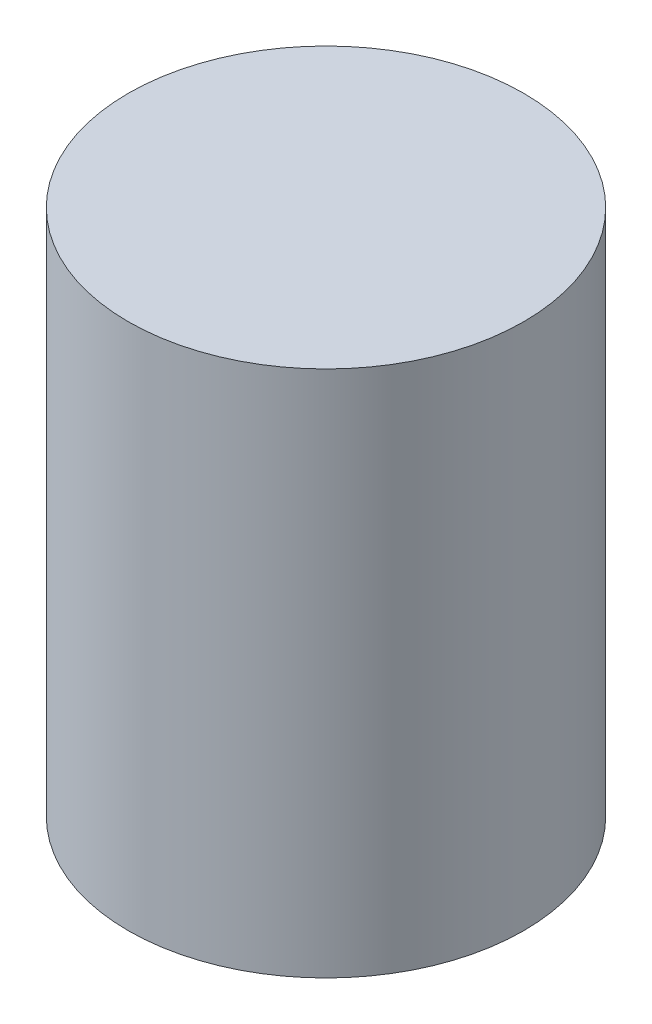
ISO-10303-21;
HEADER;
FILE_DESCRIPTION(('STEP AP214'),'2;1');
FILE_NAME('part.step','',(''),(''),'','','');
FILE_SCHEMA(('AUTOMOTIVE_DESIGN { 1 0 10303 214 1 1 1 1 }'));
ENDSEC;
DATA;
#1=APPLICATION_CONTEXT('core data for automotive mechanical design processes');
#2=APPLICATION_PROTOCOL_DEFINITION('international standard','automotive_design',2000,#1);
#3=PRODUCT_CONTEXT('',#1,'mechanical');
#4=PRODUCT('Part','Part','',(#3));
#5=PRODUCT_RELATED_PRODUCT_CATEGORY('part','',(#4));
#6=PRODUCT_DEFINITION_FORMATION('','',#4);
#7=PRODUCT_DEFINITION_CONTEXT('part definition',#1,'design');
#8=PRODUCT_DEFINITION('design','',#6,#7);
#9=PRODUCT_DEFINITION_SHAPE('','',#8);
#10=(LENGTH_UNIT() NAMED_UNIT(*) SI_UNIT(.MILLI.,.METRE.));
#11=(NAMED_UNIT(*) PLANE_ANGLE_UNIT() SI_UNIT($,.RADIAN.));
#12=(NAMED_UNIT(*) SI_UNIT($,.STERADIAN.) SOLID_ANGLE_UNIT());
#13=UNCERTAINTY_MEASURE_WITH_UNIT(LENGTH_MEASURE(1.E-05),#10,'distance_accuracy_value','');
#14=(GEOMETRIC_REPRESENTATION_CONTEXT(3) GLOBAL_UNCERTAINTY_ASSIGNED_CONTEXT((#13)) GLOBAL_UNIT_ASSIGNED_CONTEXT((#10,
#11,#12)) REPRESENTATION_CONTEXT('',''));
#15=CARTESIAN_POINT('',(0.,0.,0.));
#16=DIRECTION('',(0.,0.,1.));
#17=DIRECTION('',(1.,0.,0.));
#18=AXIS2_PLACEMENT_3D('',#15,#16,#17);
#19=CARTESIAN_POINT('',(0.,4.,0.));
#20=DIRECTION('',(0.,-1.,0.));
#21=DIRECTION('',(0.,0.,-1.));
#22=AXIS2_PLACEMENT_3D('',#19,#20,#21);
#23=CYLINDRICAL_SURFACE('',#22,1.5);
#24=CARTESIAN_POINT('',(0.,4.,0.));
#25=DIRECTION('',(0.,1.,0.));
#26=DIRECTION('',(0.,0.,1.));
#27=AXIS2_PLACEMENT_3D('',#24,#25,#26);
#28=CIRCLE('',#27,1.5);
#29=CARTESIAN_POINT('',(0.,4.,1.5));
#30=VERTEX_POINT('',#29);
#31=EDGE_CURVE('E10',#30,#30,#28,.T.);
#32=ORIENTED_EDGE('',*,*,#31,.F.);
#33=EDGE_LOOP('',(#32));
#34=FACE_BOUND('',#33,.T.);
#35=CARTESIAN_POINT('',(0.,0.,0.));
#36=DIRECTION('',(0.,1.,0.));
#37=DIRECTION('',(0.,0.,1.));
#38=AXIS2_PLACEMENT_3D('',#35,#36,#37);
#39=CIRCLE('',#38,1.5);
#40=CARTESIAN_POINT('',(0.,0.,1.5));
#41=VERTEX_POINT('',#40);
#42=EDGE_CURVE('E46',#41,#41,#39,.T.);
#43=ORIENTED_EDGE('',*,*,#42,.T.);
#44=EDGE_LOOP('',(#43));
#45=FACE_BOUND('',#44,.T.);
#46=ADVANCED_FACE('F43',(#34,#45),#23,.T.);
#47=CARTESIAN_POINT('',(0.,4.,0.));
#48=DIRECTION('',(0.,1.,0.));
#49=DIRECTION('',(0.,0.,1.));
#50=AXIS2_PLACEMENT_3D('',#47,#48,#49);
#51=PLANE('',#50);
#52=ORIENTED_EDGE('',*,*,#31,.T.);
#53=EDGE_LOOP('',(#52));
#54=FACE_BOUND('',#53,.T.);
#55=ADVANCED_FACE('F58',(#54),#51,.T.);
#56=CARTESIAN_POINT('',(0.,0.,0.));
#57=DIRECTION('',(0.,1.,0.));
#58=DIRECTION('',(0.,0.,1.));
#59=AXIS2_PLACEMENT_3D('',#56,#57,#58);
#60=PLANE('',#59);
#61=ORIENTED_EDGE('',*,*,#42,.F.);
#62=EDGE_LOOP('',(#61));
#63=FACE_BOUND('',#62,.T.);
#64=ADVANCED_FACE('F56',(#63),#60,.F.);
#65=CLOSED_SHELL('',(#46,#55,#64));
#66=MANIFOLD_SOLID_BREP('B2',#65);
#67=ADVANCED_BREP_SHAPE_REPRESENTATION('',(#18,#66),#14);
#68=SHAPE_DEFINITION_REPRESENTATION(#9,#67);
ENDSEC;
END-ISO-10303-21;
